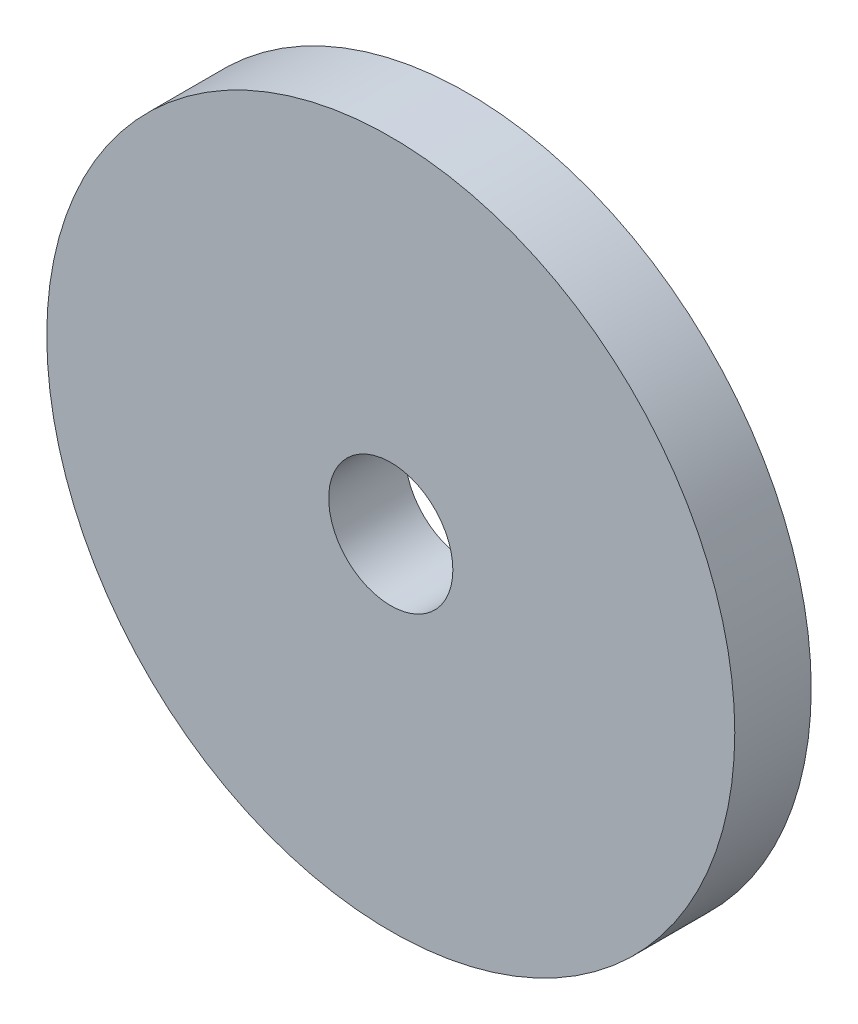
ISO-10303-21;
HEADER;
FILE_DESCRIPTION(('STEP AP214'),'2;1');
FILE_NAME('part.step','',(''),(''),'','','');
FILE_SCHEMA(('AUTOMOTIVE_DESIGN { 1 0 10303 214 1 1 1 1 }'));
ENDSEC;
DATA;
#1=APPLICATION_CONTEXT('core data for automotive mechanical design processes');
#2=APPLICATION_PROTOCOL_DEFINITION('international standard','automotive_design',2000,#1);
#3=PRODUCT_CONTEXT('',#1,'mechanical');
#4=PRODUCT('Part','Part','',(#3));
#5=PRODUCT_RELATED_PRODUCT_CATEGORY('part','',(#4));
#6=PRODUCT_DEFINITION_FORMATION('','',#4);
#7=PRODUCT_DEFINITION_CONTEXT('part definition',#1,'design');
#8=PRODUCT_DEFINITION('design','',#6,#7);
#9=PRODUCT_DEFINITION_SHAPE('','',#8);
#10=(LENGTH_UNIT() NAMED_UNIT(*) SI_UNIT(.MILLI.,.METRE.));
#11=(NAMED_UNIT(*) PLANE_ANGLE_UNIT() SI_UNIT($,.RADIAN.));
#12=(NAMED_UNIT(*) SI_UNIT($,.STERADIAN.) SOLID_ANGLE_UNIT());
#13=UNCERTAINTY_MEASURE_WITH_UNIT(LENGTH_MEASURE(1.E-05),#10,'distance_accuracy_value','');
#14=(GEOMETRIC_REPRESENTATION_CONTEXT(3) GLOBAL_UNCERTAINTY_ASSIGNED_CONTEXT((#13)) GLOBAL_UNIT_ASSIGNED_CONTEXT((#10,
#11,#12)) REPRESENTATION_CONTEXT('',''));
#15=CARTESIAN_POINT('',(0.,0.,0.));
#16=DIRECTION('',(0.,0.,1.));
#17=DIRECTION('',(1.,0.,0.));
#18=AXIS2_PLACEMENT_3D('',#15,#16,#17);
#19=CARTESIAN_POINT('',(0.,0.,6.34999999999999));
#20=DIRECTION('',(0.,0.,1.));
#21=DIRECTION('',(1.,0.,0.));
#22=AXIS2_PLACEMENT_3D('',#19,#20,#21);
#23=PLANE('',#22);
#24=CARTESIAN_POINT('',(0.,0.,6.34999999999999));
#25=DIRECTION('',(0.,0.,1.));
#26=DIRECTION('',(1.,0.,0.));
#27=AXIS2_PLACEMENT_3D('',#24,#25,#26);
#28=CIRCLE('',#27,28.575);
#29=CARTESIAN_POINT('',(28.575,0.,6.34999999999999));
#30=VERTEX_POINT('',#29);
#31=EDGE_CURVE('E12',#30,#30,#28,.T.);
#32=ORIENTED_EDGE('',*,*,#31,.T.);
#33=EDGE_LOOP('',(#32));
#34=FACE_BOUND('',#33,.T.);
#35=CARTESIAN_POINT('',(0.,0.,6.34999999999999));
#36=DIRECTION('',(0.,0.,1.));
#37=DIRECTION('',(1.,0.,0.));
#38=AXIS2_PLACEMENT_3D('',#35,#36,#37);
#39=CIRCLE('',#38,5.1562);
#40=CARTESIAN_POINT('',(5.1562,0.,6.34999999999999));
#41=VERTEX_POINT('',#40);
#42=EDGE_CURVE('E53',#41,#41,#39,.T.);
#43=ORIENTED_EDGE('',*,*,#42,.F.);
#44=EDGE_LOOP('',(#43));
#45=FACE_BOUND('',#44,.T.);
#46=ADVANCED_FACE('F42',(#34,#45),#23,.T.);
#47=CARTESIAN_POINT('',(0.,0.,0.));
#48=DIRECTION('',(0.,0.,1.));
#49=DIRECTION('',(1.,0.,0.));
#50=AXIS2_PLACEMENT_3D('',#47,#48,#49);
#51=PLANE('',#50);
#52=CARTESIAN_POINT('',(0.,0.,0.));
#53=DIRECTION('',(0.,0.,1.));
#54=DIRECTION('',(1.,0.,0.));
#55=AXIS2_PLACEMENT_3D('',#52,#53,#54);
#56=CIRCLE('',#55,28.575);
#57=CARTESIAN_POINT('',(28.575,0.,0.));
#58=VERTEX_POINT('',#57);
#59=EDGE_CURVE('E46',#58,#58,#56,.T.);
#60=ORIENTED_EDGE('',*,*,#59,.F.);
#61=EDGE_LOOP('',(#60));
#62=FACE_BOUND('',#61,.T.);
#63=CARTESIAN_POINT('',(0.,0.,0.));
#64=DIRECTION('',(0.,0.,1.));
#65=DIRECTION('',(1.,0.,0.));
#66=AXIS2_PLACEMENT_3D('',#63,#64,#65);
#67=CIRCLE('',#66,5.1562);
#68=CARTESIAN_POINT('',(5.1562,0.,0.));
#69=VERTEX_POINT('',#68);
#70=EDGE_CURVE('E55',#69,#69,#67,.T.);
#71=ORIENTED_EDGE('',*,*,#70,.T.);
#72=EDGE_LOOP('',(#71));
#73=FACE_BOUND('',#72,.T.);
#74=ADVANCED_FACE('F65',(#62,#73),#51,.F.);
#75=CARTESIAN_POINT('',(0.,0.,6.34999999999999));
#76=DIRECTION('',(0.,0.,-1.));
#77=DIRECTION('',(-1.,0.,0.));
#78=AXIS2_PLACEMENT_3D('',#75,#76,#77);
#79=CYLINDRICAL_SURFACE('',#78,28.575);
#80=ORIENTED_EDGE('',*,*,#31,.F.);
#81=EDGE_LOOP('',(#80));
#82=FACE_BOUND('',#81,.T.);
#83=ORIENTED_EDGE('',*,*,#59,.T.);
#84=EDGE_LOOP('',(#83));
#85=FACE_BOUND('',#84,.T.);
#86=ADVANCED_FACE('F44',(#82,#85),#79,.T.);
#87=CARTESIAN_POINT('',(0.,0.,6.34999999999999));
#88=DIRECTION('',(0.,0.,-1.));
#89=DIRECTION('',(-1.,0.,0.));
#90=AXIS2_PLACEMENT_3D('',#87,#88,#89);
#91=CYLINDRICAL_SURFACE('',#90,5.1562);
#92=ORIENTED_EDGE('',*,*,#42,.T.);
#93=EDGE_LOOP('',(#92));
#94=FACE_BOUND('',#93,.T.);
#95=ORIENTED_EDGE('',*,*,#70,.F.);
#96=EDGE_LOOP('',(#95));
#97=FACE_BOUND('',#96,.T.);
#98=ADVANCED_FACE('F61',(#94,#97),#91,.F.);
#99=CLOSED_SHELL('',(#46,#74,#86,#98));
#100=MANIFOLD_SOLID_BREP('B2',#99);
#101=ADVANCED_BREP_SHAPE_REPRESENTATION('',(#18,#100),#14);
#102=SHAPE_DEFINITION_REPRESENTATION(#9,#101);
ENDSEC;
END-ISO-10303-21;
